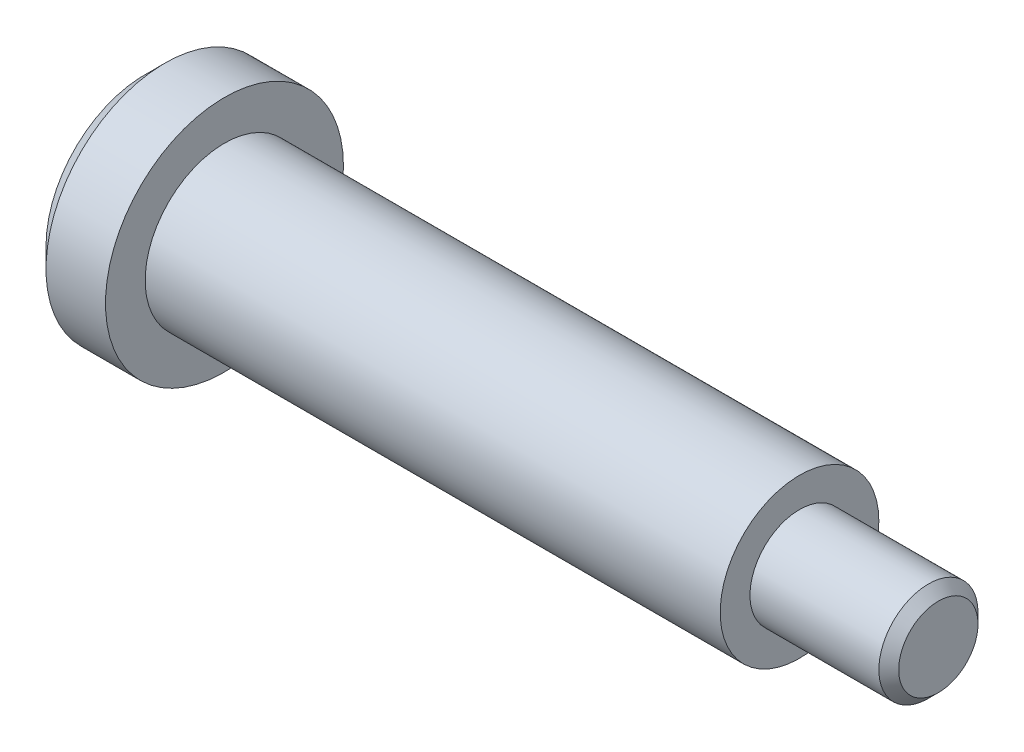
ISO-10303-21;
HEADER;
FILE_DESCRIPTION(('STEP AP214'),'2;1');
FILE_NAME('part.step','',(''),(''),'','','');
FILE_SCHEMA(('AUTOMOTIVE_DESIGN { 1 0 10303 214 1 1 1 1 }'));
ENDSEC;
DATA;
#1=APPLICATION_CONTEXT('core data for automotive mechanical design processes');
#2=APPLICATION_PROTOCOL_DEFINITION('international standard','automotive_design',2000,#1);
#3=PRODUCT_CONTEXT('',#1,'mechanical');
#4=PRODUCT('Part','Part','',(#3));
#5=PRODUCT_RELATED_PRODUCT_CATEGORY('part','',(#4));
#6=PRODUCT_DEFINITION_FORMATION('','',#4);
#7=PRODUCT_DEFINITION_CONTEXT('part definition',#1,'design');
#8=PRODUCT_DEFINITION('design','',#6,#7);
#9=PRODUCT_DEFINITION_SHAPE('','',#8);
#10=(LENGTH_UNIT() NAMED_UNIT(*) SI_UNIT(.MILLI.,.METRE.));
#11=(NAMED_UNIT(*) PLANE_ANGLE_UNIT() SI_UNIT($,.RADIAN.));
#12=(NAMED_UNIT(*) SI_UNIT($,.STERADIAN.) SOLID_ANGLE_UNIT());
#13=UNCERTAINTY_MEASURE_WITH_UNIT(LENGTH_MEASURE(1.E-05),#10,'distance_accuracy_value','');
#14=(GEOMETRIC_REPRESENTATION_CONTEXT(3) GLOBAL_UNCERTAINTY_ASSIGNED_CONTEXT((#13)) GLOBAL_UNIT_ASSIGNED_CONTEXT((#10,
#11,#12)) REPRESENTATION_CONTEXT('',''));
#15=CARTESIAN_POINT('',(0.,0.,0.));
#16=DIRECTION('',(0.,0.,1.));
#17=DIRECTION('',(1.,0.,0.));
#18=AXIS2_PLACEMENT_3D('',#15,#16,#17);
#19=CARTESIAN_POINT('',(2.,0.,0.));
#20=DIRECTION('',(-1.,0.,0.));
#21=DIRECTION('',(0.,0.,1.));
#22=AXIS2_PLACEMENT_3D('',#19,#20,#21);
#23=CYLINDRICAL_SURFACE('',#22,3.);
#24=CARTESIAN_POINT('',(0.5,0.,0.));
#25=DIRECTION('',(1.,0.,0.));
#26=DIRECTION('',(0.,0.,-1.));
#27=AXIS2_PLACEMENT_3D('',#24,#25,#26);
#28=CIRCLE('',#27,3.);
#29=CARTESIAN_POINT('',(0.5,0.,-3.));
#30=VERTEX_POINT('',#29);
#31=EDGE_CURVE('E46',#30,#30,#28,.T.);
#32=ORIENTED_EDGE('',*,*,#31,.T.);
#33=EDGE_LOOP('',(#32));
#34=FACE_BOUND('',#33,.T.);
#35=CARTESIAN_POINT('',(2.,0.,0.));
#36=DIRECTION('',(1.,0.,0.));
#37=DIRECTION('',(0.,0.,-1.));
#38=AXIS2_PLACEMENT_3D('',#35,#36,#37);
#39=CIRCLE('',#38,3.);
#40=CARTESIAN_POINT('',(2.,0.,-3.));
#41=VERTEX_POINT('',#40);
#42=EDGE_CURVE('E58',#41,#41,#39,.T.);
#43=ORIENTED_EDGE('',*,*,#42,.F.);
#44=EDGE_LOOP('',(#43));
#45=FACE_BOUND('',#44,.T.);
#46=ADVANCED_FACE('F31',(#34,#45),#23,.T.);
#47=CARTESIAN_POINT('',(2.,0.,0.));
#48=DIRECTION('',(1.,0.,0.));
#49=DIRECTION('',(0.,0.,-1.));
#50=AXIS2_PLACEMENT_3D('',#47,#48,#49);
#51=PLANE('',#50);
#52=CARTESIAN_POINT('',(2.,0.,0.));
#53=DIRECTION('',(1.,0.,0.));
#54=DIRECTION('',(0.,0.,-1.));
#55=AXIS2_PLACEMENT_3D('',#52,#53,#54);
#56=CIRCLE('',#55,2.);
#57=CARTESIAN_POINT('',(2.,0.,-2.));
#58=VERTEX_POINT('',#57);
#59=EDGE_CURVE('E61',#58,#58,#56,.T.);
#60=ORIENTED_EDGE('',*,*,#59,.F.);
#61=EDGE_LOOP('',(#60));
#62=FACE_BOUND('',#61,.T.);
#63=ORIENTED_EDGE('',*,*,#42,.T.);
#64=EDGE_LOOP('',(#63));
#65=FACE_BOUND('',#64,.T.);
#66=ADVANCED_FACE('F88',(#62,#65),#51,.T.);
#67=CARTESIAN_POINT('',(0.,0.,0.));
#68=DIRECTION('',(1.,0.,0.));
#69=DIRECTION('',(0.,0.,-1.));
#70=AXIS2_PLACEMENT_3D('',#67,#68,#69);
#71=PLANE('',#70);
#72=CARTESIAN_POINT('',(0.,0.,0.));
#73=DIRECTION('',(1.,0.,0.));
#74=DIRECTION('',(0.,0.,-1.));
#75=AXIS2_PLACEMENT_3D('',#72,#73,#74);
#76=CIRCLE('',#75,1.5);
#77=CARTESIAN_POINT('',(0.,0.,-1.5));
#78=VERTEX_POINT('',#77);
#79=EDGE_CURVE('E10',#78,#78,#76,.T.);
#80=ORIENTED_EDGE('',*,*,#79,.T.);
#81=EDGE_LOOP('',(#80));
#82=FACE_BOUND('',#81,.T.);
#83=CARTESIAN_POINT('',(0.,0.,0.));
#84=DIRECTION('',(1.,0.,0.));
#85=DIRECTION('',(0.,0.,-1.));
#86=AXIS2_PLACEMENT_3D('',#83,#84,#85);
#87=CIRCLE('',#86,2.5);
#88=CARTESIAN_POINT('',(0.,0.,-2.5));
#89=VERTEX_POINT('',#88);
#90=EDGE_CURVE('E42',#89,#89,#87,.F.);
#91=ORIENTED_EDGE('',*,*,#90,.T.);
#92=EDGE_LOOP('',(#91));
#93=FACE_BOUND('',#92,.T.);
#94=ADVANCED_FACE('F94',(#82,#93),#71,.F.);
#95=CARTESIAN_POINT('',(16.5,0.,0.));
#96=DIRECTION('',(-1.,0.,0.));
#97=DIRECTION('',(0.,0.,1.));
#98=AXIS2_PLACEMENT_3D('',#95,#96,#97);
#99=CYLINDRICAL_SURFACE('',#98,2.);
#100=CARTESIAN_POINT('',(16.5,0.,0.));
#101=DIRECTION('',(1.,0.,0.));
#102=DIRECTION('',(0.,0.,-1.));
#103=AXIS2_PLACEMENT_3D('',#100,#101,#102);
#104=CIRCLE('',#103,2.);
#105=CARTESIAN_POINT('',(16.5,0.,-2.));
#106=VERTEX_POINT('',#105);
#107=EDGE_CURVE('E62',#106,#106,#104,.T.);
#108=ORIENTED_EDGE('',*,*,#107,.F.);
#109=EDGE_LOOP('',(#108));
#110=FACE_BOUND('',#109,.T.);
#111=ORIENTED_EDGE('',*,*,#59,.T.);
#112=EDGE_LOOP('',(#111));
#113=FACE_BOUND('',#112,.T.);
#114=ADVANCED_FACE('F120',(#110,#113),#99,.T.);
#115=CARTESIAN_POINT('',(16.5,0.,0.));
#116=DIRECTION('',(1.,0.,0.));
#117=DIRECTION('',(0.,0.,-1.));
#118=AXIS2_PLACEMENT_3D('',#115,#116,#117);
#119=PLANE('',#118);
#120=CARTESIAN_POINT('',(16.5,0.,0.));
#121=DIRECTION('',(1.,0.,0.));
#122=DIRECTION('',(0.,0.,-1.));
#123=AXIS2_PLACEMENT_3D('',#120,#121,#122);
#124=CIRCLE('',#123,1.25);
#125=CARTESIAN_POINT('',(16.5,0.,-1.25));
#126=VERTEX_POINT('',#125);
#127=EDGE_CURVE('E57',#126,#126,#124,.T.);
#128=ORIENTED_EDGE('',*,*,#127,.F.);
#129=EDGE_LOOP('',(#128));
#130=FACE_BOUND('',#129,.T.);
#131=ORIENTED_EDGE('',*,*,#107,.T.);
#132=EDGE_LOOP('',(#131));
#133=FACE_BOUND('',#132,.T.);
#134=ADVANCED_FACE('F114',(#130,#133),#119,.T.);
#135=CARTESIAN_POINT('',(20.,0.,0.));
#136=DIRECTION('',(-1.,0.,0.));
#137=DIRECTION('',(0.,0.,1.));
#138=AXIS2_PLACEMENT_3D('',#135,#136,#137);
#139=CYLINDRICAL_SURFACE('',#138,1.25);
#140=CARTESIAN_POINT('',(19.75,0.,0.));
#141=DIRECTION('',(1.,0.,0.));
#142=DIRECTION('',(0.,0.,-1.));
#143=AXIS2_PLACEMENT_3D('',#140,#141,#142);
#144=CIRCLE('',#143,1.25);
#145=CARTESIAN_POINT('',(19.75,0.,-1.25));
#146=VERTEX_POINT('',#145);
#147=EDGE_CURVE('E51',#146,#146,#144,.F.);
#148=ORIENTED_EDGE('',*,*,#147,.T.);
#149=EDGE_LOOP('',(#148));
#150=FACE_BOUND('',#149,.T.);
#151=ORIENTED_EDGE('',*,*,#127,.T.);
#152=EDGE_LOOP('',(#151));
#153=FACE_BOUND('',#152,.T.);
#154=ADVANCED_FACE('F106',(#150,#153),#139,.T.);
#155=CARTESIAN_POINT('',(20.,0.,0.));
#156=DIRECTION('',(1.,0.,0.));
#157=DIRECTION('',(0.,0.,-1.));
#158=AXIS2_PLACEMENT_3D('',#155,#156,#157);
#159=PLANE('',#158);
#160=CARTESIAN_POINT('',(20.,0.,0.));
#161=DIRECTION('',(1.,0.,0.));
#162=DIRECTION('',(0.,0.,-1.));
#163=AXIS2_PLACEMENT_3D('',#160,#161,#162);
#164=CIRCLE('',#163,1.);
#165=CARTESIAN_POINT('',(20.,0.,-1.));
#166=VERTEX_POINT('',#165);
#167=EDGE_CURVE('E54',#166,#166,#164,.T.);
#168=ORIENTED_EDGE('',*,*,#167,.T.);
#169=EDGE_LOOP('',(#168));
#170=FACE_BOUND('',#169,.T.);
#171=ADVANCED_FACE('F101',(#170),#159,.T.);
#172=CARTESIAN_POINT('',(20.,0.,0.));
#173=DIRECTION('',(-1.,0.,0.));
#174=DIRECTION('',(0.,0.,1.));
#175=AXIS2_PLACEMENT_3D('',#172,#173,#174);
#176=CONICAL_SURFACE('',#175,1.,0.785398163397446);
#177=ORIENTED_EDGE('',*,*,#147,.F.);
#178=EDGE_LOOP('',(#177));
#179=FACE_BOUND('',#178,.T.);
#180=ORIENTED_EDGE('',*,*,#167,.F.);
#181=EDGE_LOOP('',(#180));
#182=FACE_BOUND('',#181,.T.);
#183=ADVANCED_FACE('F84',(#179,#182),#176,.T.);
#184=CARTESIAN_POINT('',(0.5,0.,0.));
#185=DIRECTION('',(1.,0.,0.));
#186=DIRECTION('',(0.,0.,-1.));
#187=AXIS2_PLACEMENT_3D('',#184,#185,#186);
#188=CONICAL_SURFACE('',#187,3.,0.78539816339745);
#189=ORIENTED_EDGE('',*,*,#90,.F.);
#190=EDGE_LOOP('',(#189));
#191=FACE_BOUND('',#190,.T.);
#192=ORIENTED_EDGE('',*,*,#31,.F.);
#193=EDGE_LOOP('',(#192));
#194=FACE_BOUND('',#193,.T.);
#195=ADVANCED_FACE('F77',(#191,#194),#188,.T.);
#196=CARTESIAN_POINT('',(0.5,0.,0.));
#197=DIRECTION('',(-1.,0.,0.));
#198=DIRECTION('',(0.,0.,1.));
#199=AXIS2_PLACEMENT_3D('',#196,#197,#198);
#200=CYLINDRICAL_SURFACE('',#199,1.25);
#201=CARTESIAN_POINT('',(0.25,0.,0.));
#202=DIRECTION('',(1.,0.,0.));
#203=DIRECTION('',(0.,0.,-1.));
#204=AXIS2_PLACEMENT_3D('',#201,#202,#203);
#205=CIRCLE('',#204,1.25);
#206=CARTESIAN_POINT('',(0.25,0.,-1.25));
#207=VERTEX_POINT('',#206);
#208=EDGE_CURVE('E38',#207,#207,#205,.F.);
#209=ORIENTED_EDGE('',*,*,#208,.T.);
#210=EDGE_LOOP('',(#209));
#211=FACE_BOUND('',#210,.T.);
#212=CARTESIAN_POINT('',(0.5,0.,0.));
#213=DIRECTION('',(-1.,0.,0.));
#214=DIRECTION('',(0.,0.,1.));
#215=AXIS2_PLACEMENT_3D('',#212,#213,#214);
#216=CIRCLE('',#215,1.25);
#217=CARTESIAN_POINT('',(0.5,0.,1.25));
#218=VERTEX_POINT('',#217);
#219=EDGE_CURVE('E67',#218,#218,#216,.T.);
#220=ORIENTED_EDGE('',*,*,#219,.F.);
#221=EDGE_LOOP('',(#220));
#222=FACE_BOUND('',#221,.T.);
#223=ADVANCED_FACE('F75',(#211,#222),#200,.F.);
#224=CARTESIAN_POINT('',(0.5,0.,0.));
#225=DIRECTION('',(-1.,0.,0.));
#226=DIRECTION('',(0.,0.,1.));
#227=AXIS2_PLACEMENT_3D('',#224,#225,#226);
#228=PLANE('',#227);
#229=ORIENTED_EDGE('',*,*,#219,.T.);
#230=EDGE_LOOP('',(#229));
#231=FACE_BOUND('',#230,.T.);
#232=ADVANCED_FACE('F73',(#231),#228,.T.);
#233=CARTESIAN_POINT('',(0.25,0.,0.));
#234=DIRECTION('',(1.,0.,0.));
#235=DIRECTION('',(0.,0.,-1.));
#236=AXIS2_PLACEMENT_3D('',#233,#234,#235);
#237=TOROIDAL_SURFACE('',#236,1.5,0.25);
#238=ORIENTED_EDGE('',*,*,#79,.F.);
#239=EDGE_LOOP('',(#238));
#240=FACE_BOUND('',#239,.T.);
#241=ORIENTED_EDGE('',*,*,#208,.F.);
#242=EDGE_LOOP('',(#241));
#243=FACE_BOUND('',#242,.T.);
#244=ADVANCED_FACE('F33',(#240,#243),#237,.T.);
#245=CLOSED_SHELL('',(#46,#66,#94,#114,#134,#154,#171,#183,#195,#223,#232,#244));
#246=MANIFOLD_SOLID_BREP('B2',#245);
#247=ADVANCED_BREP_SHAPE_REPRESENTATION('',(#18,#246),#14);
#248=SHAPE_DEFINITION_REPRESENTATION(#9,#247);
ENDSEC;
END-ISO-10303-21;
